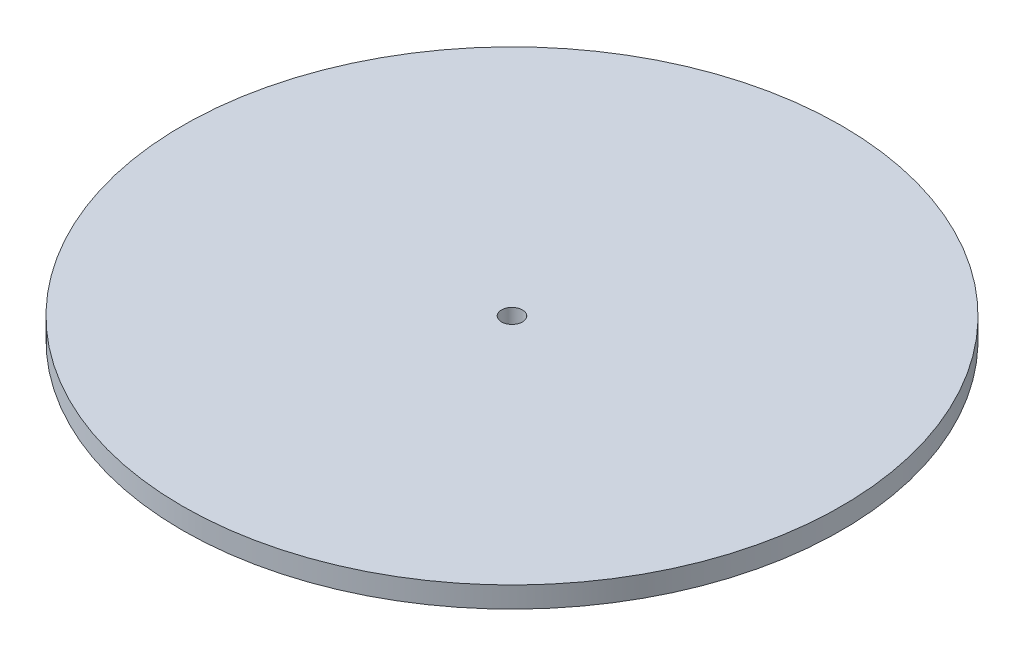
ISO-10303-21;
HEADER;
FILE_DESCRIPTION(('STEP AP214'),'2;1');
FILE_NAME('part.step','',(''),(''),'','','');
FILE_SCHEMA(('AUTOMOTIVE_DESIGN { 1 0 10303 214 1 1 1 1 }'));
ENDSEC;
DATA;
#1=APPLICATION_CONTEXT('core data for automotive mechanical design processes');
#2=APPLICATION_PROTOCOL_DEFINITION('international standard','automotive_design',2000,#1);
#3=PRODUCT_CONTEXT('',#1,'mechanical');
#4=PRODUCT('Part','Part','',(#3));
#5=PRODUCT_RELATED_PRODUCT_CATEGORY('part','',(#4));
#6=PRODUCT_DEFINITION_FORMATION('','',#4);
#7=PRODUCT_DEFINITION_CONTEXT('part definition',#1,'design');
#8=PRODUCT_DEFINITION('design','',#6,#7);
#9=PRODUCT_DEFINITION_SHAPE('','',#8);
#10=(LENGTH_UNIT() NAMED_UNIT(*) SI_UNIT(.MILLI.,.METRE.));
#11=(NAMED_UNIT(*) PLANE_ANGLE_UNIT() SI_UNIT($,.RADIAN.));
#12=(NAMED_UNIT(*) SI_UNIT($,.STERADIAN.) SOLID_ANGLE_UNIT());
#13=UNCERTAINTY_MEASURE_WITH_UNIT(LENGTH_MEASURE(1.E-05),#10,'distance_accuracy_value','');
#14=(GEOMETRIC_REPRESENTATION_CONTEXT(3) GLOBAL_UNCERTAINTY_ASSIGNED_CONTEXT((#13)) GLOBAL_UNIT_ASSIGNED_CONTEXT((#10,
#11,#12)) REPRESENTATION_CONTEXT('',''));
#15=CARTESIAN_POINT('',(0.,0.,0.));
#16=DIRECTION('',(0.,0.,1.));
#17=DIRECTION('',(1.,0.,0.));
#18=AXIS2_PLACEMENT_3D('',#15,#16,#17);
#19=CARTESIAN_POINT('',(0.,25.4,0.));
#20=DIRECTION('',(0.,1.,0.));
#21=DIRECTION('',(0.,0.,1.));
#22=AXIS2_PLACEMENT_3D('',#19,#20,#21);
#23=PLANE('',#22);
#24=CARTESIAN_POINT('',(0.,25.4,0.));
#25=DIRECTION('',(0.,1.,0.));
#26=DIRECTION('',(0.,0.,1.));
#27=AXIS2_PLACEMENT_3D('',#24,#25,#26);
#28=CIRCLE('',#27,400.);
#29=CARTESIAN_POINT('',(0.,25.4,400.));
#30=VERTEX_POINT('',#29);
#31=EDGE_CURVE('E10',#30,#30,#28,.T.);
#32=ORIENTED_EDGE('',*,*,#31,.T.);
#33=EDGE_LOOP('',(#32));
#34=FACE_BOUND('',#33,.T.);
#35=CARTESIAN_POINT('',(0.,25.4,0.));
#36=DIRECTION('',(0.,1.,0.));
#37=DIRECTION('',(0.,0.,1.));
#38=AXIS2_PLACEMENT_3D('',#35,#36,#37);
#39=CIRCLE('',#38,12.7);
#40=CARTESIAN_POINT('',(0.,25.4,12.7));
#41=VERTEX_POINT('',#40);
#42=EDGE_CURVE('E42',#41,#41,#39,.T.);
#43=ORIENTED_EDGE('',*,*,#42,.F.);
#44=EDGE_LOOP('',(#43));
#45=FACE_BOUND('',#44,.T.);
#46=ADVANCED_FACE('F31',(#34,#45),#23,.T.);
#47=CARTESIAN_POINT('',(0.,0.,0.));
#48=DIRECTION('',(0.,1.,0.));
#49=DIRECTION('',(0.,0.,1.));
#50=AXIS2_PLACEMENT_3D('',#47,#48,#49);
#51=PLANE('',#50);
#52=CARTESIAN_POINT('',(0.,0.,0.));
#53=DIRECTION('',(0.,1.,0.));
#54=DIRECTION('',(0.,0.,1.));
#55=AXIS2_PLACEMENT_3D('',#52,#53,#54);
#56=CIRCLE('',#55,400.);
#57=CARTESIAN_POINT('',(0.,0.,400.));
#58=VERTEX_POINT('',#57);
#59=EDGE_CURVE('E35',#58,#58,#56,.T.);
#60=ORIENTED_EDGE('',*,*,#59,.F.);
#61=EDGE_LOOP('',(#60));
#62=FACE_BOUND('',#61,.T.);
#63=CARTESIAN_POINT('',(0.,0.,0.));
#64=DIRECTION('',(0.,1.,0.));
#65=DIRECTION('',(0.,0.,1.));
#66=AXIS2_PLACEMENT_3D('',#63,#64,#65);
#67=CIRCLE('',#66,12.7);
#68=CARTESIAN_POINT('',(0.,0.,12.7));
#69=VERTEX_POINT('',#68);
#70=EDGE_CURVE('E44',#69,#69,#67,.T.);
#71=ORIENTED_EDGE('',*,*,#70,.T.);
#72=EDGE_LOOP('',(#71));
#73=FACE_BOUND('',#72,.T.);
#74=ADVANCED_FACE('F54',(#62,#73),#51,.F.);
#75=CARTESIAN_POINT('',(0.,25.4,0.));
#76=DIRECTION('',(0.,-1.,0.));
#77=DIRECTION('',(0.,0.,-1.));
#78=AXIS2_PLACEMENT_3D('',#75,#76,#77);
#79=CYLINDRICAL_SURFACE('',#78,400.);
#80=ORIENTED_EDGE('',*,*,#31,.F.);
#81=EDGE_LOOP('',(#80));
#82=FACE_BOUND('',#81,.T.);
#83=ORIENTED_EDGE('',*,*,#59,.T.);
#84=EDGE_LOOP('',(#83));
#85=FACE_BOUND('',#84,.T.);
#86=ADVANCED_FACE('F33',(#82,#85),#79,.T.);
#87=CARTESIAN_POINT('',(0.,25.4,0.));
#88=DIRECTION('',(0.,-1.,0.));
#89=DIRECTION('',(0.,0.,-1.));
#90=AXIS2_PLACEMENT_3D('',#87,#88,#89);
#91=CYLINDRICAL_SURFACE('',#90,12.7);
#92=ORIENTED_EDGE('',*,*,#42,.T.);
#93=EDGE_LOOP('',(#92));
#94=FACE_BOUND('',#93,.T.);
#95=ORIENTED_EDGE('',*,*,#70,.F.);
#96=EDGE_LOOP('',(#95));
#97=FACE_BOUND('',#96,.T.);
#98=ADVANCED_FACE('F50',(#94,#97),#91,.F.);
#99=CLOSED_SHELL('',(#46,#74,#86,#98));
#100=MANIFOLD_SOLID_BREP('B2',#99);
#101=ADVANCED_BREP_SHAPE_REPRESENTATION('',(#18,#100),#14);
#102=SHAPE_DEFINITION_REPRESENTATION(#9,#101);
ENDSEC;
END-ISO-10303-21;
